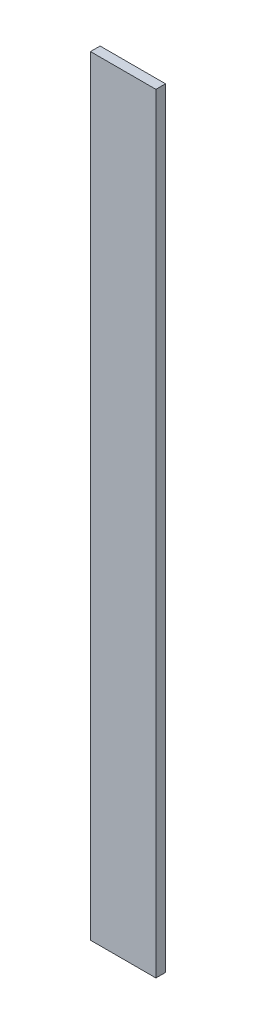
ISO-10303-21;
HEADER;
FILE_DESCRIPTION(('STEP AP214'),'2;1');
FILE_NAME('part.step','',(''),(''),'','','');
FILE_SCHEMA(('AUTOMOTIVE_DESIGN { 1 0 10303 214 1 1 1 1 }'));
ENDSEC;
DATA;
#1=APPLICATION_CONTEXT('core data for automotive mechanical design processes');
#2=APPLICATION_PROTOCOL_DEFINITION('international standard','automotive_design',2000,#1);
#3=PRODUCT_CONTEXT('',#1,'mechanical');
#4=PRODUCT('Part','Part','',(#3));
#5=PRODUCT_RELATED_PRODUCT_CATEGORY('part','',(#4));
#6=PRODUCT_DEFINITION_FORMATION('','',#4);
#7=PRODUCT_DEFINITION_CONTEXT('part definition',#1,'design');
#8=PRODUCT_DEFINITION('design','',#6,#7);
#9=PRODUCT_DEFINITION_SHAPE('','',#8);
#10=(LENGTH_UNIT() NAMED_UNIT(*) SI_UNIT(.MILLI.,.METRE.));
#11=(NAMED_UNIT(*) PLANE_ANGLE_UNIT() SI_UNIT($,.RADIAN.));
#12=(NAMED_UNIT(*) SI_UNIT($,.STERADIAN.) SOLID_ANGLE_UNIT());
#13=UNCERTAINTY_MEASURE_WITH_UNIT(LENGTH_MEASURE(1.E-05),#10,'distance_accuracy_value','');
#14=(GEOMETRIC_REPRESENTATION_CONTEXT(3) GLOBAL_UNCERTAINTY_ASSIGNED_CONTEXT((#13)) GLOBAL_UNIT_ASSIGNED_CONTEXT((#10,
#11,#12)) REPRESENTATION_CONTEXT('',''));
#15=CARTESIAN_POINT('',(0.,0.,0.));
#16=DIRECTION('',(0.,0.,1.));
#17=DIRECTION('',(1.,0.,0.));
#18=AXIS2_PLACEMENT_3D('',#15,#16,#17);
#19=CARTESIAN_POINT('',(0.,508.,0.));
#20=DIRECTION('',(1.,0.,0.));
#21=DIRECTION('',(0.,0.,-1.));
#22=AXIS2_PLACEMENT_3D('',#19,#20,#21);
#23=PLANE('',#22);
#24=DIRECTION('',(0.,0.,1.));
#25=VECTOR('',#24,1.);
#26=CARTESIAN_POINT('',(0.,0.,0.));
#27=LINE('',#26,#25);
#28=CARTESIAN_POINT('',(0.,0.,-6.35));
#29=VERTEX_POINT('',#28);
#30=CARTESIAN_POINT('',(0.,0.,0.));
#31=VERTEX_POINT('',#30);
#32=EDGE_CURVE('E97',#29,#31,#27,.T.);
#33=ORIENTED_EDGE('',*,*,#32,.T.);
#34=DIRECTION('',(0.,-1.,0.));
#35=VECTOR('',#34,1.);
#36=CARTESIAN_POINT('',(0.,508.,0.));
#37=LINE('',#36,#35);
#38=CARTESIAN_POINT('',(0.,508.,0.));
#39=VERTEX_POINT('',#38);
#40=EDGE_CURVE('E11',#39,#31,#37,.T.);
#41=ORIENTED_EDGE('',*,*,#40,.F.);
#42=DIRECTION('',(0.,0.,1.));
#43=VECTOR('',#42,1.);
#44=CARTESIAN_POINT('',(0.,508.,0.));
#45=LINE('',#44,#43);
#46=CARTESIAN_POINT('',(0.,508.,-6.35));
#47=VERTEX_POINT('',#46);
#48=EDGE_CURVE('E85',#47,#39,#45,.T.);
#49=ORIENTED_EDGE('',*,*,#48,.F.);
#50=DIRECTION('',(0.,-1.,0.));
#51=VECTOR('',#50,1.);
#52=CARTESIAN_POINT('',(0.,508.,-6.35));
#53=LINE('',#52,#51);
#54=EDGE_CURVE('E93',#47,#29,#53,.T.);
#55=ORIENTED_EDGE('',*,*,#54,.T.);
#56=EDGE_LOOP('',(#33,#41,#49,#55));
#57=FACE_BOUND('',#56,.T.);
#58=ADVANCED_FACE('F34',(#57),#23,.F.);
#59=CARTESIAN_POINT('',(0.,508.,0.));
#60=DIRECTION('',(0.,0.,-1.));
#61=DIRECTION('',(-1.,0.,0.));
#62=AXIS2_PLACEMENT_3D('',#59,#60,#61);
#63=PLANE('',#62);
#64=DIRECTION('',(1.,0.,0.));
#65=VECTOR('',#64,1.);
#66=CARTESIAN_POINT('',(0.,0.,0.));
#67=LINE('',#66,#65);
#68=CARTESIAN_POINT('',(43.18,0.,0.));
#69=VERTEX_POINT('',#68);
#70=EDGE_CURVE('E89',#31,#69,#67,.T.);
#71=ORIENTED_EDGE('',*,*,#70,.T.);
#72=DIRECTION('',(0.,-1.,0.));
#73=VECTOR('',#72,1.);
#74=CARTESIAN_POINT('',(43.18,508.,0.));
#75=LINE('',#74,#73);
#76=CARTESIAN_POINT('',(43.18,508.,0.));
#77=VERTEX_POINT('',#76);
#78=EDGE_CURVE('E42',#77,#69,#75,.T.);
#79=ORIENTED_EDGE('',*,*,#78,.F.);
#80=DIRECTION('',(1.,0.,0.));
#81=VECTOR('',#80,1.);
#82=CARTESIAN_POINT('',(0.,508.,0.));
#83=LINE('',#82,#81);
#84=EDGE_CURVE('E80',#39,#77,#83,.T.);
#85=ORIENTED_EDGE('',*,*,#84,.F.);
#86=ORIENTED_EDGE('',*,*,#40,.T.);
#87=EDGE_LOOP('',(#71,#79,#85,#86));
#88=FACE_BOUND('',#87,.T.);
#89=ADVANCED_FACE('F88',(#88),#63,.F.);
#90=CARTESIAN_POINT('',(43.18,508.,0.));
#91=DIRECTION('',(-1.,0.,0.));
#92=DIRECTION('',(0.,0.,1.));
#93=AXIS2_PLACEMENT_3D('',#90,#91,#92);
#94=PLANE('',#93);
#95=DIRECTION('',(0.,0.,-1.));
#96=VECTOR('',#95,1.);
#97=CARTESIAN_POINT('',(43.18,0.,0.));
#98=LINE('',#97,#96);
#99=CARTESIAN_POINT('',(43.18,0.,-6.35));
#100=VERTEX_POINT('',#99);
#101=EDGE_CURVE('E67',#69,#100,#98,.T.);
#102=ORIENTED_EDGE('',*,*,#101,.T.);
#103=DIRECTION('',(0.,-1.,0.));
#104=VECTOR('',#103,1.);
#105=CARTESIAN_POINT('',(43.18,508.,-6.35));
#106=LINE('',#105,#104);
#107=CARTESIAN_POINT('',(43.18,508.,-6.35));
#108=VERTEX_POINT('',#107);
#109=EDGE_CURVE('E90',#108,#100,#106,.T.);
#110=ORIENTED_EDGE('',*,*,#109,.F.);
#111=DIRECTION('',(0.,0.,-1.));
#112=VECTOR('',#111,1.);
#113=CARTESIAN_POINT('',(43.18,508.,0.));
#114=LINE('',#113,#112);
#115=EDGE_CURVE('E83',#77,#108,#114,.T.);
#116=ORIENTED_EDGE('',*,*,#115,.F.);
#117=ORIENTED_EDGE('',*,*,#78,.T.);
#118=EDGE_LOOP('',(#102,#110,#116,#117));
#119=FACE_BOUND('',#118,.T.);
#120=ADVANCED_FACE('F91',(#119),#94,.F.);
#121=CARTESIAN_POINT('',(0.,508.,-6.35));
#122=DIRECTION('',(0.,0.,1.));
#123=DIRECTION('',(1.,0.,0.));
#124=AXIS2_PLACEMENT_3D('',#121,#122,#123);
#125=PLANE('',#124);
#126=DIRECTION('',(-1.,0.,0.));
#127=VECTOR('',#126,1.);
#128=CARTESIAN_POINT('',(0.,0.,-6.35));
#129=LINE('',#128,#127);
#130=EDGE_CURVE('E73',#100,#29,#129,.T.);
#131=ORIENTED_EDGE('',*,*,#130,.T.);
#132=ORIENTED_EDGE('',*,*,#54,.F.);
#133=DIRECTION('',(-1.,0.,0.));
#134=VECTOR('',#133,1.);
#135=CARTESIAN_POINT('',(0.,508.,-6.35));
#136=LINE('',#135,#134);
#137=EDGE_CURVE('E50',#108,#47,#136,.T.);
#138=ORIENTED_EDGE('',*,*,#137,.F.);
#139=ORIENTED_EDGE('',*,*,#109,.T.);
#140=EDGE_LOOP('',(#131,#132,#138,#139));
#141=FACE_BOUND('',#140,.T.);
#142=ADVANCED_FACE('F104',(#141),#125,.F.);
#143=CARTESIAN_POINT('',(0.,508.,0.));
#144=DIRECTION('',(0.,-1.,0.));
#145=DIRECTION('',(0.,0.,-1.));
#146=AXIS2_PLACEMENT_3D('',#143,#144,#145);
#147=PLANE('',#146);
#148=ORIENTED_EDGE('',*,*,#48,.T.);
#149=ORIENTED_EDGE('',*,*,#84,.T.);
#150=ORIENTED_EDGE('',*,*,#115,.T.);
#151=ORIENTED_EDGE('',*,*,#137,.T.);
#152=EDGE_LOOP('',(#148,#149,#150,#151));
#153=FACE_BOUND('',#152,.T.);
#154=ADVANCED_FACE('F81',(#153),#147,.F.);
#155=CARTESIAN_POINT('',(0.,0.,0.));
#156=DIRECTION('',(0.,-1.,0.));
#157=DIRECTION('',(0.,0.,-1.));
#158=AXIS2_PLACEMENT_3D('',#155,#156,#157);
#159=PLANE('',#158);
#160=ORIENTED_EDGE('',*,*,#32,.F.);
#161=ORIENTED_EDGE('',*,*,#130,.F.);
#162=ORIENTED_EDGE('',*,*,#101,.F.);
#163=ORIENTED_EDGE('',*,*,#70,.F.);
#164=EDGE_LOOP('',(#160,#161,#162,#163));
#165=FACE_BOUND('',#164,.T.);
#166=ADVANCED_FACE('F107',(#165),#159,.T.);
#167=CLOSED_SHELL('',(#58,#89,#120,#142,#154,#166));
#168=MANIFOLD_SOLID_BREP('B2',#167);
#169=ADVANCED_BREP_SHAPE_REPRESENTATION('',(#18,#168),#14);
#170=SHAPE_DEFINITION_REPRESENTATION(#9,#169);
ENDSEC;
END-ISO-10303-21;
